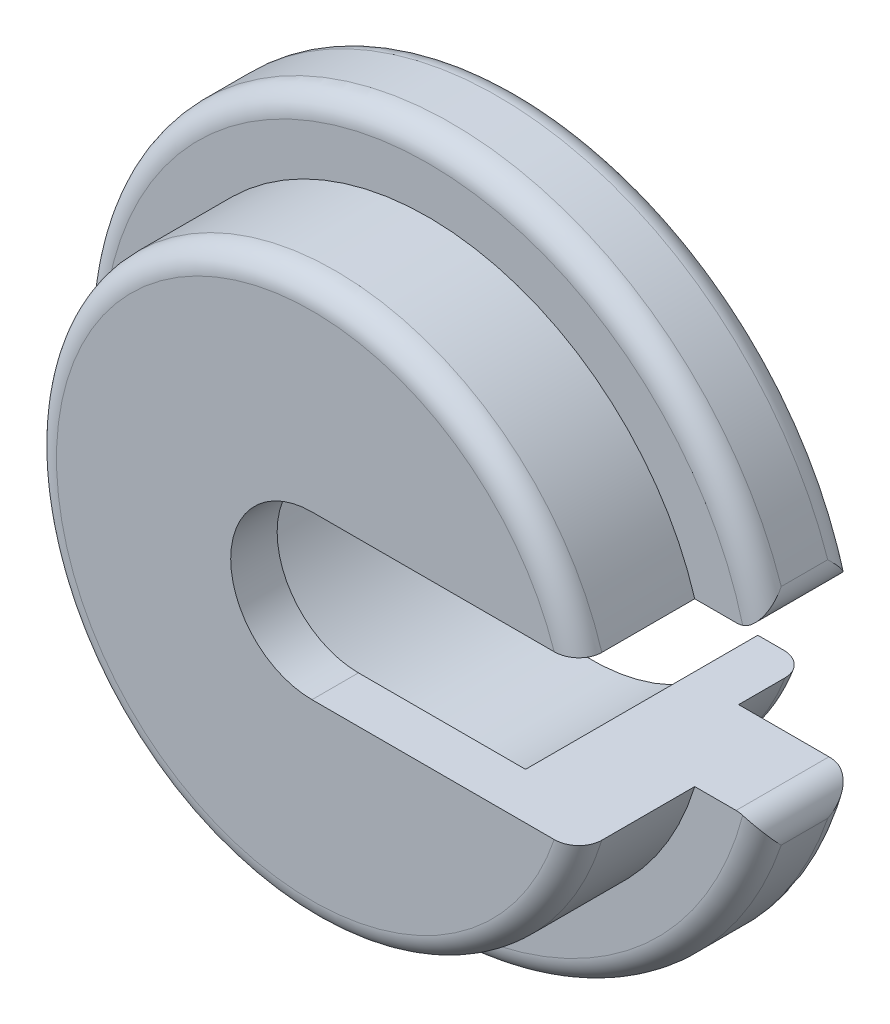
ISO-10303-21;
HEADER;
FILE_DESCRIPTION(('STEP AP214'),'2;1');
FILE_NAME('part.step','',(''),(''),'','','');
FILE_SCHEMA(('AUTOMOTIVE_DESIGN { 1 0 10303 214 1 1 1 1 }'));
ENDSEC;
DATA;
#1=APPLICATION_CONTEXT('core data for automotive mechanical design processes');
#2=APPLICATION_PROTOCOL_DEFINITION('international standard','automotive_design',2000,#1);
#3=PRODUCT_CONTEXT('',#1,'mechanical');
#4=PRODUCT('Part','Part','',(#3));
#5=PRODUCT_RELATED_PRODUCT_CATEGORY('part','',(#4));
#6=PRODUCT_DEFINITION_FORMATION('','',#4);
#7=PRODUCT_DEFINITION_CONTEXT('part definition',#1,'design');
#8=PRODUCT_DEFINITION('design','',#6,#7);
#9=PRODUCT_DEFINITION_SHAPE('','',#8);
#10=(LENGTH_UNIT() NAMED_UNIT(*) SI_UNIT(.MILLI.,.METRE.));
#11=(NAMED_UNIT(*) PLANE_ANGLE_UNIT() SI_UNIT($,.RADIAN.));
#12=(NAMED_UNIT(*) SI_UNIT($,.STERADIAN.) SOLID_ANGLE_UNIT());
#13=UNCERTAINTY_MEASURE_WITH_UNIT(LENGTH_MEASURE(1.E-05),#10,'distance_accuracy_value','');
#14=(GEOMETRIC_REPRESENTATION_CONTEXT(3) GLOBAL_UNCERTAINTY_ASSIGNED_CONTEXT((#13)) GLOBAL_UNIT_ASSIGNED_CONTEXT((#10,
#11,#12)) REPRESENTATION_CONTEXT('',''));
#15=CARTESIAN_POINT('',(0.,0.,0.));
#16=DIRECTION('',(0.,0.,1.));
#17=DIRECTION('',(1.,0.,0.));
#18=AXIS2_PLACEMENT_3D('',#15,#16,#17);
#19=CARTESIAN_POINT('',(0.,0.,0.));
#20=DIRECTION('',(0.,0.,1.));
#21=DIRECTION('',(1.,0.,0.));
#22=AXIS2_PLACEMENT_3D('',#19,#20,#21);
#23=PLANE('',#22);
#24=DIRECTION('',(1.,0.,0.));
#25=VECTOR('',#24,1.);
#26=CARTESIAN_POINT('',(0.,-1.75,0.));
#27=LINE('',#26,#25);
#28=CARTESIAN_POINT('',(4.6837484987988,-1.75,0.));
#29=VERTEX_POINT('',#28);
#30=CARTESIAN_POINT('',(6.62853679178143,-1.75,0.));
#31=VERTEX_POINT('',#30);
#32=EDGE_CURVE('E184',#29,#31,#27,.T.);
#33=ORIENTED_EDGE('',*,*,#32,.T.);
#34=CARTESIAN_POINT('',(6.62853679178142,-2.25,0.));
#35=DIRECTION('',(0.,0.,1.));
#36=DIRECTION('',(1.,0.,0.));
#37=AXIS2_PLACEMENT_3D('',#34,#35,#36);
#38=CIRCLE('',#37,0.5);
#39=CARTESIAN_POINT('',(6.77223901580328,-1.77109534267125,0.));
#40=VERTEX_POINT('',#39);
#41=EDGE_CURVE('E312',#31,#40,#38,.F.);
#42=ORIENTED_EDGE('',*,*,#41,.T.);
#43=CARTESIAN_POINT('',(0.,0.,0.));
#44=DIRECTION('',(0.,0.,1.));
#45=DIRECTION('',(1.,0.,0.));
#46=AXIS2_PLACEMENT_3D('',#43,#44,#45);
#47=CIRCLE('',#46,7.);
#48=CARTESIAN_POINT('',(6.77223901580328,1.77109534267125,0.));
#49=VERTEX_POINT('',#48);
#50=EDGE_CURVE('E315',#40,#49,#47,.F.);
#51=ORIENTED_EDGE('',*,*,#50,.T.);
#52=CARTESIAN_POINT('',(6.62853679178142,2.25,0.));
#53=DIRECTION('',(0.,0.,1.));
#54=DIRECTION('',(1.,0.,0.));
#55=AXIS2_PLACEMENT_3D('',#52,#53,#54);
#56=CIRCLE('',#55,0.5);
#57=CARTESIAN_POINT('',(6.62853679178142,1.75,0.));
#58=VERTEX_POINT('',#57);
#59=EDGE_CURVE('E314',#49,#58,#56,.F.);
#60=ORIENTED_EDGE('',*,*,#59,.T.);
#61=DIRECTION('',(-1.,0.,0.));
#62=VECTOR('',#61,1.);
#63=CARTESIAN_POINT('',(0.,1.75,0.));
#64=LINE('',#63,#62);
#65=CARTESIAN_POINT('',(4.6837484987988,1.75,0.));
#66=VERTEX_POINT('',#65);
#67=EDGE_CURVE('E196',#58,#66,#64,.T.);
#68=ORIENTED_EDGE('',*,*,#67,.T.);
#69=CARTESIAN_POINT('',(0.,0.,0.));
#70=DIRECTION('',(0.,0.,1.));
#71=DIRECTION('',(1.,0.,0.));
#72=AXIS2_PLACEMENT_3D('',#69,#70,#71);
#73=CIRCLE('',#72,5.);
#74=EDGE_CURVE('E212',#29,#66,#73,.F.);
#75=ORIENTED_EDGE('',*,*,#74,.F.);
#76=EDGE_LOOP('',(#33,#42,#51,#60,#68,#75));
#77=FACE_BOUND('',#76,.T.);
#78=ADVANCED_FACE('F31',(#77),#23,.F.);
#79=CARTESIAN_POINT('',(0.,0.,2.));
#80=DIRECTION('',(0.,0.,1.));
#81=DIRECTION('',(1.,0.,0.));
#82=AXIS2_PLACEMENT_3D('',#79,#80,#81);
#83=PLANE('',#82);
#84=CARTESIAN_POINT('',(0.,0.,2.));
#85=DIRECTION('',(0.,0.,1.));
#86=DIRECTION('',(1.,0.,0.));
#87=AXIS2_PLACEMENT_3D('',#84,#85,#86);
#88=CIRCLE('',#87,7.);
#89=CARTESIAN_POINT('',(6.77223901580328,1.77109534267125,2.));
#90=VERTEX_POINT('',#89);
#91=CARTESIAN_POINT('',(6.77223901580328,-1.77109534267125,2.));
#92=VERTEX_POINT('',#91);
#93=EDGE_CURVE('E229',#90,#92,#88,.T.);
#94=ORIENTED_EDGE('',*,*,#93,.T.);
#95=CARTESIAN_POINT('',(6.62853679178142,-2.25,2.));
#96=DIRECTION('',(0.,0.,1.));
#97=DIRECTION('',(1.,0.,0.));
#98=AXIS2_PLACEMENT_3D('',#95,#96,#97);
#99=CIRCLE('',#98,0.5);
#100=CARTESIAN_POINT('',(6.62853679178143,-1.75,2.));
#101=VERTEX_POINT('',#100);
#102=EDGE_CURVE('E233',#92,#101,#99,.T.);
#103=ORIENTED_EDGE('',*,*,#102,.T.);
#104=DIRECTION('',(1.,0.,0.));
#105=VECTOR('',#104,1.);
#106=CARTESIAN_POINT('',(0.,-1.75,2.));
#107=LINE('',#106,#105);
#108=CARTESIAN_POINT('',(5.7391201416245,-1.75,2.));
#109=VERTEX_POINT('',#108);
#110=EDGE_CURVE('E187',#109,#101,#107,.T.);
#111=ORIENTED_EDGE('',*,*,#110,.F.);
#112=CARTESIAN_POINT('',(0.,0.,2.));
#113=DIRECTION('',(0.,0.,1.));
#114=DIRECTION('',(1.,0.,0.));
#115=AXIS2_PLACEMENT_3D('',#112,#113,#114);
#116=CIRCLE('',#115,6.);
#117=CARTESIAN_POINT('',(5.7391201416245,1.75,2.));
#118=VERTEX_POINT('',#117);
#119=EDGE_CURVE('E209',#118,#109,#116,.T.);
#120=ORIENTED_EDGE('',*,*,#119,.F.);
#121=DIRECTION('',(-1.,0.,0.));
#122=VECTOR('',#121,1.);
#123=CARTESIAN_POINT('',(0.,1.75,2.));
#124=LINE('',#123,#122);
#125=CARTESIAN_POINT('',(6.62853679178142,1.75,2.));
#126=VERTEX_POINT('',#125);
#127=EDGE_CURVE('E198',#126,#118,#124,.T.);
#128=ORIENTED_EDGE('',*,*,#127,.F.);
#129=CARTESIAN_POINT('',(6.62853679178142,2.25,2.));
#130=DIRECTION('',(0.,0.,1.));
#131=DIRECTION('',(1.,0.,0.));
#132=AXIS2_PLACEMENT_3D('',#129,#130,#131);
#133=CIRCLE('',#132,0.5);
#134=EDGE_CURVE('E231',#126,#90,#133,.T.);
#135=ORIENTED_EDGE('',*,*,#134,.T.);
#136=EDGE_LOOP('',(#94,#103,#111,#120,#128,#135));
#137=FACE_BOUND('',#136,.T.);
#138=ADVANCED_FACE('F283',(#137),#83,.T.);
#139=CARTESIAN_POINT('',(0.,0.,2.));
#140=DIRECTION('',(0.,0.,-1.));
#141=DIRECTION('',(-1.,0.,0.));
#142=AXIS2_PLACEMENT_3D('',#139,#140,#141);
#143=CYLINDRICAL_SURFACE('',#142,7.5);
#144=CARTESIAN_POINT('',(0.,0.,0.5));
#145=DIRECTION('',(0.,0.,1.));
#146=DIRECTION('',(1.,0.,0.));
#147=AXIS2_PLACEMENT_3D('',#144,#145,#146);
#148=CIRCLE('',#147,7.5);
#149=CARTESIAN_POINT('',(7.1020037054801,2.41071428571429,0.5));
#150=VERTEX_POINT('',#149);
#151=CARTESIAN_POINT('',(7.1020037054801,-2.41071428571429,0.5));
#152=VERTEX_POINT('',#151);
#153=EDGE_CURVE('E224',#150,#152,#148,.T.);
#154=ORIENTED_EDGE('',*,*,#153,.T.);
#155=DIRECTION('',(0.,0.,-1.));
#156=VECTOR('',#155,1.);
#157=CARTESIAN_POINT('',(7.1020037054801,-2.41071428571429,2.));
#158=LINE('',#157,#156);
#159=CARTESIAN_POINT('',(7.1020037054801,-2.41071428571429,1.5));
#160=VERTEX_POINT('',#159);
#161=EDGE_CURVE('E226',#152,#160,#158,.F.);
#162=ORIENTED_EDGE('',*,*,#161,.T.);
#163=CARTESIAN_POINT('',(0.,0.,1.5));
#164=DIRECTION('',(0.,0.,1.));
#165=DIRECTION('',(1.,0.,0.));
#166=AXIS2_PLACEMENT_3D('',#163,#164,#165);
#167=CIRCLE('',#166,7.5);
#168=CARTESIAN_POINT('',(7.1020037054801,2.41071428571429,1.5));
#169=VERTEX_POINT('',#168);
#170=EDGE_CURVE('E220',#160,#169,#167,.F.);
#171=ORIENTED_EDGE('',*,*,#170,.T.);
#172=DIRECTION('',(0.,0.,-1.));
#173=VECTOR('',#172,1.);
#174=CARTESIAN_POINT('',(7.1020037054801,2.41071428571429,2.));
#175=LINE('',#174,#173);
#176=EDGE_CURVE('E222',#169,#150,#175,.T.);
#177=ORIENTED_EDGE('',*,*,#176,.T.);
#178=EDGE_LOOP('',(#154,#162,#171,#177));
#179=FACE_BOUND('',#178,.T.);
#180=ADVANCED_FACE('F33',(#179),#143,.T.);
#181=CARTESIAN_POINT('',(0.,0.,4.5));
#182=DIRECTION('',(0.,0.,-1.));
#183=DIRECTION('',(-1.,0.,0.));
#184=AXIS2_PLACEMENT_3D('',#181,#182,#183);
#185=CYLINDRICAL_SURFACE('',#184,6.);
#186=DIRECTION('',(0.,0.,-1.));
#187=VECTOR('',#186,1.);
#188=CARTESIAN_POINT('',(5.7391201416245,-1.75,4.5));
#189=LINE('',#188,#187);
#190=CARTESIAN_POINT('',(5.7391201416245,-1.75,4.));
#191=VERTEX_POINT('',#190);
#192=EDGE_CURVE('E189',#109,#191,#189,.F.);
#193=ORIENTED_EDGE('',*,*,#192,.T.);
#194=CARTESIAN_POINT('',(0.,0.,4.));
#195=DIRECTION('',(0.,0.,1.));
#196=DIRECTION('',(1.,0.,0.));
#197=AXIS2_PLACEMENT_3D('',#194,#195,#196);
#198=CIRCLE('',#197,6.);
#199=CARTESIAN_POINT('',(5.7391201416245,1.75,4.));
#200=VERTEX_POINT('',#199);
#201=EDGE_CURVE('E11',#191,#200,#198,.F.);
#202=ORIENTED_EDGE('',*,*,#201,.T.);
#203=DIRECTION('',(0.,0.,-1.));
#204=VECTOR('',#203,1.);
#205=CARTESIAN_POINT('',(5.7391201416245,1.75,4.5));
#206=LINE('',#205,#204);
#207=EDGE_CURVE('E201',#200,#118,#206,.T.);
#208=ORIENTED_EDGE('',*,*,#207,.T.);
#209=ORIENTED_EDGE('',*,*,#119,.T.);
#210=EDGE_LOOP('',(#193,#202,#208,#209));
#211=FACE_BOUND('',#210,.T.);
#212=ADVANCED_FACE('F279',(#211),#185,.T.);
#213=CARTESIAN_POINT('',(0.,0.,4.5));
#214=DIRECTION('',(0.,0.,1.));
#215=DIRECTION('',(1.,0.,0.));
#216=AXIS2_PLACEMENT_3D('',#213,#214,#215);
#217=PLANE('',#216);
#218=DIRECTION('',(-1.,0.,0.));
#219=VECTOR('',#218,1.);
#220=CARTESIAN_POINT('',(0.,1.75,4.5));
#221=LINE('',#220,#219);
#222=CARTESIAN_POINT('',(5.21416340365355,1.75,4.5));
#223=VERTEX_POINT('',#222);
#224=CARTESIAN_POINT('',(0.,1.75,4.5));
#225=VERTEX_POINT('',#224);
#226=EDGE_CURVE('E169',#223,#225,#221,.T.);
#227=ORIENTED_EDGE('',*,*,#226,.F.);
#228=CARTESIAN_POINT('',(0.,0.,4.5));
#229=DIRECTION('',(0.,0.,1.));
#230=DIRECTION('',(1.,0.,0.));
#231=AXIS2_PLACEMENT_3D('',#228,#229,#230);
#232=CIRCLE('',#231,5.5);
#233=CARTESIAN_POINT('',(5.21416340365355,-1.75,4.5));
#234=VERTEX_POINT('',#233);
#235=EDGE_CURVE('E39',#223,#234,#232,.T.);
#236=ORIENTED_EDGE('',*,*,#235,.T.);
#237=DIRECTION('',(1.,0.,0.));
#238=VECTOR('',#237,1.);
#239=CARTESIAN_POINT('',(0.,-1.75,4.5));
#240=LINE('',#239,#238);
#241=CARTESIAN_POINT('',(0.,-1.75,4.5));
#242=VERTEX_POINT('',#241);
#243=EDGE_CURVE('E149',#242,#234,#240,.T.);
#244=ORIENTED_EDGE('',*,*,#243,.F.);
#245=CARTESIAN_POINT('',(0.,0.,4.5));
#246=DIRECTION('',(0.,0.,1.));
#247=DIRECTION('',(1.,0.,0.));
#248=AXIS2_PLACEMENT_3D('',#245,#246,#247);
#249=CIRCLE('',#248,1.75);
#250=EDGE_CURVE('E159',#225,#242,#249,.T.);
#251=ORIENTED_EDGE('',*,*,#250,.F.);
#252=EDGE_LOOP('',(#227,#236,#244,#251));
#253=FACE_BOUND('',#252,.T.);
#254=ADVANCED_FACE('F167',(#253),#217,.T.);
#255=CARTESIAN_POINT('',(0.,0.,-1.5));
#256=DIRECTION('',(0.,0.,1.));
#257=DIRECTION('',(1.,0.,0.));
#258=AXIS2_PLACEMENT_3D('',#255,#256,#257);
#259=CYLINDRICAL_SURFACE('',#258,5.);
#260=DIRECTION('',(0.,0.,1.));
#261=VECTOR('',#260,1.);
#262=CARTESIAN_POINT('',(4.6837484987988,1.75,-1.5));
#263=LINE('',#262,#261);
#264=CARTESIAN_POINT('',(4.6837484987988,1.75,-1.));
#265=VERTEX_POINT('',#264);
#266=EDGE_CURVE('E194',#66,#265,#263,.F.);
#267=ORIENTED_EDGE('',*,*,#266,.T.);
#268=CARTESIAN_POINT('',(0.,0.,-1.));
#269=DIRECTION('',(0.,0.,-1.));
#270=DIRECTION('',(-1.,0.,0.));
#271=AXIS2_PLACEMENT_3D('',#268,#269,#270);
#272=CIRCLE('',#271,5.);
#273=CARTESIAN_POINT('',(4.6837484987988,-1.75,-1.));
#274=VERTEX_POINT('',#273);
#275=EDGE_CURVE('E376',#265,#274,#272,.F.);
#276=ORIENTED_EDGE('',*,*,#275,.T.);
#277=DIRECTION('',(0.,0.,1.));
#278=VECTOR('',#277,1.);
#279=CARTESIAN_POINT('',(4.6837484987988,-1.75,-1.5));
#280=LINE('',#279,#278);
#281=EDGE_CURVE('E182',#274,#29,#280,.T.);
#282=ORIENTED_EDGE('',*,*,#281,.T.);
#283=ORIENTED_EDGE('',*,*,#74,.T.);
#284=EDGE_LOOP('',(#267,#276,#282,#283));
#285=FACE_BOUND('',#284,.T.);
#286=ADVANCED_FACE('F272',(#285),#259,.T.);
#287=CARTESIAN_POINT('',(0.,0.,-1.5));
#288=DIRECTION('',(0.,0.,-1.));
#289=DIRECTION('',(-1.,0.,0.));
#290=AXIS2_PLACEMENT_3D('',#287,#288,#289);
#291=PLANE('',#290);
#292=DIRECTION('',(1.,0.,0.));
#293=VECTOR('',#292,1.);
#294=CARTESIAN_POINT('',(0.,-1.75,-1.5));
#295=LINE('',#294,#293);
#296=CARTESIAN_POINT('',(3.59687364248454,-1.75,-1.5));
#297=VERTEX_POINT('',#296);
#298=CARTESIAN_POINT('',(4.14578098794425,-1.75,-1.5));
#299=VERTEX_POINT('',#298);
#300=EDGE_CURVE('E171',#297,#299,#295,.T.);
#301=ORIENTED_EDGE('',*,*,#300,.T.);
#302=CARTESIAN_POINT('',(0.,0.,-1.5));
#303=DIRECTION('',(0.,0.,-1.));
#304=DIRECTION('',(-1.,0.,0.));
#305=AXIS2_PLACEMENT_3D('',#302,#303,#304);
#306=CIRCLE('',#305,4.5);
#307=CARTESIAN_POINT('',(4.14578098794425,1.75,-1.5));
#308=VERTEX_POINT('',#307);
#309=EDGE_CURVE('E374',#299,#308,#306,.T.);
#310=ORIENTED_EDGE('',*,*,#309,.T.);
#311=DIRECTION('',(-1.,0.,0.));
#312=VECTOR('',#311,1.);
#313=CARTESIAN_POINT('',(0.,1.75,-1.5));
#314=LINE('',#313,#312);
#315=CARTESIAN_POINT('',(3.59687364248454,1.75,-1.5));
#316=VERTEX_POINT('',#315);
#317=EDGE_CURVE('E155',#308,#316,#314,.T.);
#318=ORIENTED_EDGE('',*,*,#317,.T.);
#319=CARTESIAN_POINT('',(0.,0.,-1.5));
#320=DIRECTION('',(0.,0.,-1.));
#321=DIRECTION('',(-1.,0.,0.));
#322=AXIS2_PLACEMENT_3D('',#319,#320,#321);
#323=CIRCLE('',#322,4.);
#324=EDGE_CURVE('E203',#297,#316,#323,.T.);
#325=ORIENTED_EDGE('',*,*,#324,.F.);
#326=EDGE_LOOP('',(#301,#310,#318,#325));
#327=FACE_BOUND('',#326,.T.);
#328=ADVANCED_FACE('F268',(#327),#291,.T.);
#329=CARTESIAN_POINT('',(0.,0.,3.5));
#330=DIRECTION('',(0.,0.,-1.));
#331=DIRECTION('',(-1.,0.,0.));
#332=AXIS2_PLACEMENT_3D('',#329,#330,#331);
#333=CYLINDRICAL_SURFACE('',#332,4.);
#334=ORIENTED_EDGE('',*,*,#324,.T.);
#335=DIRECTION('',(0.,0.,-1.));
#336=VECTOR('',#335,1.);
#337=CARTESIAN_POINT('',(3.59687364248454,1.75,3.5));
#338=LINE('',#337,#336);
#339=CARTESIAN_POINT('',(3.59687364248454,1.75,3.5));
#340=VERTEX_POINT('',#339);
#341=EDGE_CURVE('E191',#316,#340,#338,.F.);
#342=ORIENTED_EDGE('',*,*,#341,.T.);
#343=CARTESIAN_POINT('',(0.,0.,3.5));
#344=DIRECTION('',(0.,0.,-1.));
#345=DIRECTION('',(-1.,0.,0.));
#346=AXIS2_PLACEMENT_3D('',#343,#344,#345);
#347=CIRCLE('',#346,4.);
#348=CARTESIAN_POINT('',(3.59687364248454,-1.75,3.5));
#349=VERTEX_POINT('',#348);
#350=EDGE_CURVE('E206',#349,#340,#347,.T.);
#351=ORIENTED_EDGE('',*,*,#350,.F.);
#352=DIRECTION('',(0.,0.,-1.));
#353=VECTOR('',#352,1.);
#354=CARTESIAN_POINT('',(3.59687364248454,-1.75,3.5));
#355=LINE('',#354,#353);
#356=EDGE_CURVE('E178',#349,#297,#355,.T.);
#357=ORIENTED_EDGE('',*,*,#356,.T.);
#358=EDGE_LOOP('',(#334,#342,#351,#357));
#359=FACE_BOUND('',#358,.T.);
#360=ADVANCED_FACE('F264',(#359),#333,.F.);
#361=CARTESIAN_POINT('',(0.,0.,3.5));
#362=DIRECTION('',(0.,0.,-1.));
#363=DIRECTION('',(-1.,0.,0.));
#364=AXIS2_PLACEMENT_3D('',#361,#362,#363);
#365=PLANE('',#364);
#366=DIRECTION('',(1.,0.,0.));
#367=VECTOR('',#366,1.);
#368=CARTESIAN_POINT('',(0.,1.75,3.5));
#369=LINE('',#368,#367);
#370=CARTESIAN_POINT('',(0.,1.75,3.5));
#371=VERTEX_POINT('',#370);
#372=EDGE_CURVE('E218',#371,#340,#369,.T.);
#373=ORIENTED_EDGE('',*,*,#372,.F.);
#374=CARTESIAN_POINT('',(0.,0.,3.5));
#375=DIRECTION('',(0.,0.,-1.));
#376=DIRECTION('',(-1.,0.,0.));
#377=AXIS2_PLACEMENT_3D('',#374,#375,#376);
#378=CIRCLE('',#377,1.75);
#379=CARTESIAN_POINT('',(0.,-1.75,3.5));
#380=VERTEX_POINT('',#379);
#381=EDGE_CURVE('E216',#380,#371,#378,.T.);
#382=ORIENTED_EDGE('',*,*,#381,.F.);
#383=DIRECTION('',(-1.,0.,0.));
#384=VECTOR('',#383,1.);
#385=CARTESIAN_POINT('',(0.,-1.75,3.5));
#386=LINE('',#385,#384);
#387=EDGE_CURVE('E151',#349,#380,#386,.T.);
#388=ORIENTED_EDGE('',*,*,#387,.F.);
#389=ORIENTED_EDGE('',*,*,#350,.T.);
#390=EDGE_LOOP('',(#373,#382,#388,#389));
#391=FACE_BOUND('',#390,.T.);
#392=ADVANCED_FACE('F261',(#391),#365,.T.);
#393=CARTESIAN_POINT('',(0.,1.75,-1.5));
#394=DIRECTION('',(0.,1.,0.));
#395=DIRECTION('',(0.,0.,1.));
#396=AXIS2_PLACEMENT_3D('',#393,#394,#395);
#397=PLANE('',#396);
#398=ORIENTED_EDGE('',*,*,#67,.F.);
#399=DIRECTION('',(0.,0.,-1.));
#400=VECTOR('',#399,1.);
#401=CARTESIAN_POINT('',(6.62853679178142,1.75,-1.5));
#402=LINE('',#401,#400);
#403=EDGE_CURVE('E329',#58,#126,#402,.F.);
#404=ORIENTED_EDGE('',*,*,#403,.T.);
#405=ORIENTED_EDGE('',*,*,#127,.T.);
#406=ORIENTED_EDGE('',*,*,#207,.F.);
#407=CARTESIAN_POINT('',(5.7391201416245,1.75,4.));
#408=CARTESIAN_POINT('',(5.73914859977898,1.75,4.02722451157571));
#409=CARTESIAN_POINT('',(5.73679745142537,1.75,4.05443529477964));
#410=CARTESIAN_POINT('',(5.7275538108366,1.75,4.10802220875837));
#411=CARTESIAN_POINT('',(5.72067010588289,1.75,4.13439985125614));
#412=CARTESIAN_POINT('',(5.70257692065409,1.75,4.18562657790316));
#413=CARTESIAN_POINT('',(5.69136706720579,1.75,4.21047552997325));
#414=CARTESIAN_POINT('',(5.6650057874774,1.75,4.25798481757399));
#415=CARTESIAN_POINT('',(5.6498537907701,1.75,4.28064483571516));
#416=CARTESIAN_POINT('',(5.61579074807385,1.75,4.32358413459604));
#417=CARTESIAN_POINT('',(5.59681872337044,1.75,4.34381497425831));
#418=CARTESIAN_POINT('',(5.55586701333869,1.75,4.38095945386265));
#419=CARTESIAN_POINT('',(5.53388667474401,1.75,4.39787237135933));
#420=CARTESIAN_POINT('',(5.48657930029313,1.75,4.42865297656592));
#421=CARTESIAN_POINT('',(5.46115126535445,1.75,4.44236525600174));
#422=CARTESIAN_POINT('',(5.4084238588574,1.75,4.46553806447844));
#423=CARTESIAN_POINT('',(5.38112421763679,1.75,4.47499797934585));
#424=CARTESIAN_POINT('',(5.3305604097015,1.75,4.48815777040163));
#425=CARTESIAN_POINT('',(5.30748568085787,1.75,4.49260010905143));
#426=CARTESIAN_POINT('',(5.26099587711348,1.75,4.49852126964513));
#427=CARTESIAN_POINT('',(5.23758139978198,1.75,4.50000477868597));
#428=CARTESIAN_POINT('',(5.21416340365355,1.75,4.5));
#429=B_SPLINE_CURVE_WITH_KNOTS('',3,(#407,#408,#409,#410,#411,#412,#413,#414,#415,#416,#417,
#418,#419,#420,#421,#422,#423,#424,#425,#426,#427,#428),.UNSPECIFIED.,.F.,.F.,(4,2,2,2,2,2,2,2,
2,2,4),(0.,0.0815512735744263,0.162944907126926,0.24434556325746,0.325758004601307,
0.408591020597108,0.491442052709262,0.577729595495474,0.664029596880945,0.734340360026582,
0.804539654792602),.UNSPECIFIED.);
#430=EDGE_CURVE('E320',#200,#223,#429,.T.);
#431=ORIENTED_EDGE('',*,*,#430,.T.);
#432=ORIENTED_EDGE('',*,*,#226,.T.);
#433=DIRECTION('',(0.,0.,1.));
#434=VECTOR('',#433,1.);
#435=CARTESIAN_POINT('',(0.,1.75,-1.5));
#436=LINE('',#435,#434);
#437=EDGE_CURVE('E154',#371,#225,#436,.T.);
#438=ORIENTED_EDGE('',*,*,#437,.F.);
#439=ORIENTED_EDGE('',*,*,#372,.T.);
#440=ORIENTED_EDGE('',*,*,#341,.F.);
#441=ORIENTED_EDGE('',*,*,#317,.F.);
#442=CARTESIAN_POINT('',(4.14578098794425,1.75,-1.5));
#443=CARTESIAN_POINT('',(4.17793958901466,1.75,-1.50001747294155));
#444=CARTESIAN_POINT('',(4.21011428619823,1.75,-1.49736700552021));
#445=CARTESIAN_POINT('',(4.27364915933794,1.75,-1.4867760270329));
#446=CARTESIAN_POINT('',(4.30500744500507,1.75,-1.47882420815263));
#447=CARTESIAN_POINT('',(4.36596937769272,1.75,-1.45765867620717));
#448=CARTESIAN_POINT('',(4.39556993300684,1.75,-1.44443598973693));
#449=CARTESIAN_POINT('',(4.4519422063235,1.75,-1.41296732359334));
#450=CARTESIAN_POINT('',(4.47871702869892,1.75,-1.39472693759276));
#451=CARTESIAN_POINT('',(4.52722789022789,1.75,-1.3546504597076));
#452=CARTESIAN_POINT('',(4.54914795488512,1.75,-1.33303752605647));
#453=CARTESIAN_POINT('',(4.58871450985095,1.75,-1.28617936124539));
#454=CARTESIAN_POINT('',(4.6063609924231,1.75,-1.26093412351002));
#455=CARTESIAN_POINT('',(4.63553685467951,1.75,-1.20949031585461));
#456=CARTESIAN_POINT('',(4.64741214626956,1.75,-1.18348739046096));
#457=CARTESIAN_POINT('',(4.66632579394178,1.75,-1.12979805970136));
#458=CARTESIAN_POINT('',(4.67337202388696,1.75,-1.10211447531174));
#459=CARTESIAN_POINT('',(4.67982108897615,1.75,-1.06180426014855));
#460=CARTESIAN_POINT('',(4.68129363946103,1.75,-1.04947978188883));
#461=CARTESIAN_POINT('',(4.68325640956408,1.75,-1.02477236313839));
#462=CARTESIAN_POINT('',(4.68374817075864,1.75,-1.01238954510491));
#463=CARTESIAN_POINT('',(4.68374849879887,1.75,-1.00000000000001));
#464=B_SPLINE_CURVE_WITH_KNOTS('',3,(#442,#443,#444,#445,#446,#447,#448,#449,#450,#451,#452,
#453,#454,#455,#456,#457,#458,#459,#460,#461,#462,#463),.UNSPECIFIED.,.F.,.F.,(4,2,2,2,2,2,2,2,
2,2,4),(0.,0.0963929343184209,0.192992135984912,0.28975650047221,0.38641342729687,
0.478277298014871,0.570141335032602,0.655468934475541,0.740657072753023,0.777861149294878,
0.815006703310541),.UNSPECIFIED.);
#465=EDGE_CURVE('E52',#308,#265,#464,.T.);
#466=ORIENTED_EDGE('',*,*,#465,.T.);
#467=ORIENTED_EDGE('',*,*,#266,.F.);
#468=EDGE_LOOP('',(#398,#404,#405,#406,#431,#432,#438,#439,#440,#441,#466,#467));
#469=FACE_BOUND('',#468,.T.);
#470=ADVANCED_FACE('F254',(#469),#397,.F.);
#471=CARTESIAN_POINT('',(0.,-1.75,-1.5));
#472=DIRECTION('',(0.,-1.,0.));
#473=DIRECTION('',(0.,0.,-1.));
#474=AXIS2_PLACEMENT_3D('',#471,#472,#473);
#475=PLANE('',#474);
#476=ORIENTED_EDGE('',*,*,#110,.T.);
#477=DIRECTION('',(0.,0.,-1.));
#478=VECTOR('',#477,1.);
#479=CARTESIAN_POINT('',(6.62853679178142,-1.75,-1.5));
#480=LINE('',#479,#478);
#481=EDGE_CURVE('E310',#101,#31,#480,.T.);
#482=ORIENTED_EDGE('',*,*,#481,.T.);
#483=ORIENTED_EDGE('',*,*,#32,.F.);
#484=ORIENTED_EDGE('',*,*,#281,.F.);
#485=CARTESIAN_POINT('',(4.6837484987988,-1.75,-1.));
#486=CARTESIAN_POINT('',(4.68377880748665,-1.75,-1.02680939897035));
#487=CARTESIAN_POINT('',(4.68144877193849,-1.75,-1.05360232030611));
#488=CARTESIAN_POINT('',(4.6723028951644,-1.75,-1.106347155274));
#489=CARTESIAN_POINT('',(4.66549790671785,-1.75,-1.13230094462191));
#490=CARTESIAN_POINT('',(4.6476357181582,-1.75,-1.18269408264278));
#491=CARTESIAN_POINT('',(4.63657887533947,-1.75,-1.20713355836712));
#492=CARTESIAN_POINT('',(4.61061525369643,-1.75,-1.25387444082593));
#493=CARTESIAN_POINT('',(4.59570738685567,-1.75,-1.27617524088219));
#494=CARTESIAN_POINT('',(4.5621254108022,-1.75,-1.31862775681851));
#495=CARTESIAN_POINT('',(4.54336794394441,-1.75,-1.33871339867193));
#496=CARTESIAN_POINT('',(4.50291878960977,-1.75,-1.37566665179797));
#497=CARTESIAN_POINT('',(4.48122651803318,-1.75,-1.39253362085908));
#498=CARTESIAN_POINT('',(4.43414759139924,-1.75,-1.42365948207911));
#499=CARTESIAN_POINT('',(4.40861728192956,-1.75,-1.43770081313069));
#500=CARTESIAN_POINT('',(4.35566530860214,-1.75,-1.46161441230595));
#501=CARTESIAN_POINT('',(4.3282427033766,-1.75,-1.47148458773978));
#502=CARTESIAN_POINT('',(4.27509535300766,-1.75,-1.48614204926751));
#503=CARTESIAN_POINT('',(4.2494839477992,-1.75,-1.49134605631569));
#504=CARTESIAN_POINT('',(4.19784047278474,-1.75,-1.49827491919633));
#505=CARTESIAN_POINT('',(4.1718092395004,-1.75,-1.50000599596612));
#506=CARTESIAN_POINT('',(4.14578098794425,-1.75,-1.5));
#507=B_SPLINE_CURVE_WITH_KNOTS('',3,(#485,#486,#487,#488,#489,#490,#491,#492,#493,#494,#495,
#496,#497,#498,#499,#500,#501,#502,#503,#504,#505,#506),.UNSPECIFIED.,.F.,.F.,(4,2,2,2,2,2,2,2,
2,2,4),(0.,0.0803017546491845,0.160409473968742,0.240510463098915,0.32063410768219,
0.40272165664933,0.484825567196844,0.571862010142009,0.658942068018699,0.73711282333416,
0.815143428666879),.UNSPECIFIED.);
#508=EDGE_CURVE('E242',#274,#299,#507,.T.);
#509=ORIENTED_EDGE('',*,*,#508,.T.);
#510=ORIENTED_EDGE('',*,*,#300,.F.);
#511=ORIENTED_EDGE('',*,*,#356,.F.);
#512=ORIENTED_EDGE('',*,*,#387,.T.);
#513=DIRECTION('',(0.,0.,1.));
#514=VECTOR('',#513,1.);
#515=CARTESIAN_POINT('',(0.,-1.75,-1.5));
#516=LINE('',#515,#514);
#517=EDGE_CURVE('E144',#380,#242,#516,.T.);
#518=ORIENTED_EDGE('',*,*,#517,.T.);
#519=ORIENTED_EDGE('',*,*,#243,.T.);
#520=CARTESIAN_POINT('',(5.21416340365355,-1.75,4.5));
#521=CARTESIAN_POINT('',(5.24487065279054,-1.75,4.50001960941325));
#522=CARTESIAN_POINT('',(5.27558416493397,-1.75,4.49745835613115));
#523=CARTESIAN_POINT('',(5.33619118018395,-1.75,4.48727542954986));
#524=CARTESIAN_POINT('',(5.36608383028303,-1.75,4.47964868528837));
#525=CARTESIAN_POINT('',(5.42418684872629,-1.75,4.45942417753369));
#526=CARTESIAN_POINT('',(5.45239512752571,-1.75,4.44682038143549));
#527=CARTESIAN_POINT('',(5.50618728942885,-1.75,4.41692099318433));
#528=CARTESIAN_POINT('',(5.53177307473399,-1.75,4.39962883535695));
#529=CARTESIAN_POINT('',(5.57875543089639,-1.75,4.36135619406549));
#530=CARTESIAN_POINT('',(5.60025458166251,-1.75,4.34050179992757));
#531=CARTESIAN_POINT('',(5.63924054095762,-1.75,4.29531327503549));
#532=CARTESIAN_POINT('',(5.65672701703522,-1.75,4.27097885623107));
#533=CARTESIAN_POINT('',(5.68630866923167,-1.75,4.22076742219906));
#534=CARTESIAN_POINT('',(5.69861864477285,-1.75,4.19501670047932));
#535=CARTESIAN_POINT('',(5.71853276920456,-1.75,4.14177113116012));
#536=CARTESIAN_POINT('',(5.72614289327435,-1.75,4.11427854734768));
#537=CARTESIAN_POINT('',(5.73387755560218,-1.75,4.07210834118917));
#538=CARTESIAN_POINT('',(5.73584282680587,-1.75,4.0577462830278));
#539=CARTESIAN_POINT('',(5.73846328354111,-1.75,4.02892528651386));
#540=CARTESIAN_POINT('',(5.73912046502834,-1.75,4.01446652958979));
#541=CARTESIAN_POINT('',(5.73912014162476,-1.75,4.00000000000005));
#542=B_SPLINE_CURVE_WITH_KNOTS('',3,(#520,#521,#522,#523,#524,#525,#526,#527,#528,#529,#530,
#531,#532,#533,#534,#535,#536,#537,#538,#539,#540,#541),.UNSPECIFIED.,.F.,.F.,(4,2,2,2,2,2,2,2,
2,2,4),(0.,0.0920259840900414,0.18414423269958,0.276374480785966,0.368537349921943,
0.457937739448036,0.547345533153229,0.632550302839905,0.717646522814314,0.76108221178946,
0.804451573223965),.UNSPECIFIED.);
#543=EDGE_CURVE('E235',#234,#191,#542,.T.);
#544=ORIENTED_EDGE('',*,*,#543,.T.);
#545=ORIENTED_EDGE('',*,*,#192,.F.);
#546=EDGE_LOOP('',(#476,#482,#483,#484,#509,#510,#511,#512,#518,#519,#544,#545));
#547=FACE_BOUND('',#546,.T.);
#548=ADVANCED_FACE('F147',(#547),#475,.F.);
#549=CARTESIAN_POINT('',(0.,0.,-1.5));
#550=DIRECTION('',(0.,0.,1.));
#551=DIRECTION('',(1.,0.,0.));
#552=AXIS2_PLACEMENT_3D('',#549,#550,#551);
#553=CYLINDRICAL_SURFACE('',#552,1.75);
#554=ORIENTED_EDGE('',*,*,#381,.T.);
#555=ORIENTED_EDGE('',*,*,#437,.T.);
#556=ORIENTED_EDGE('',*,*,#250,.T.);
#557=ORIENTED_EDGE('',*,*,#517,.F.);
#558=EDGE_LOOP('',(#554,#555,#556,#557));
#559=FACE_BOUND('',#558,.T.);
#560=ADVANCED_FACE('F160',(#559),#553,.F.);
#561=CARTESIAN_POINT('',(6.62853679178142,2.25,2.));
#562=DIRECTION('',(0.,0.,-1.));
#563=DIRECTION('',(-1.,0.,0.));
#564=AXIS2_PLACEMENT_3D('',#561,#562,#563);
#565=CYLINDRICAL_SURFACE('',#564,0.5);
#566=ORIENTED_EDGE('',*,*,#403,.F.);
#567=ORIENTED_EDGE('',*,*,#59,.F.);
#568=CARTESIAN_POINT('',(6.77223901580328,1.77109534267125,0.));
#569=CARTESIAN_POINT('',(6.79392531172874,1.77756357371953,-3.53522721426997E-05));
#570=CARTESIAN_POINT('',(6.81508958297233,1.78555452714966,0.00153206800287684));
#571=CARTESIAN_POINT('',(6.85566030535027,1.80402132116905,0.00750803775757951));
#572=CARTESIAN_POINT('',(6.87508050018945,1.81447483902278,0.0118916421439867));
#573=CARTESIAN_POINT('',(6.91179124766995,1.83740141613144,0.023129912872709));
#574=CARTESIAN_POINT('',(6.92908805475435,1.84986828098597,0.0299770765735934));
#575=CARTESIAN_POINT('',(6.96145087011608,1.87636065202734,0.0457159605317059));
#576=CARTESIAN_POINT('',(6.97651155622212,1.89038974196821,0.0546124339936232));
#577=CARTESIAN_POINT('',(7.00996396929981,1.92547596987413,0.0779813685994546));
#578=CARTESIAN_POINT('',(7.02722895335283,1.9470756615051,0.0932518500116733));
#579=CARTESIAN_POINT('',(7.05739339247348,1.99153048853048,0.126084529522909));
#580=CARTESIAN_POINT('',(7.07028510734555,2.01438776750054,0.143650715452672));
#581=CARTESIAN_POINT('',(7.09589970310766,2.0689591820895,0.18693943687686));
#582=CARTESIAN_POINT('',(7.10692825498934,2.10092921722352,0.213339187914916));
#583=CARTESIAN_POINT('',(7.12234215038554,2.16490557602469,0.267947242131054));
#584=CARTESIAN_POINT('',(7.12671896617357,2.19691189371805,0.296157818659743));
#585=CARTESIAN_POINT('',(7.12940254202278,2.25945520247073,0.352921405893001));
#586=CARTESIAN_POINT('',(7.1278517159514,2.29000902974152,0.381450164507183));
#587=CARTESIAN_POINT('',(7.11939258136213,2.34985506730149,0.438922921227178));
#588=CARTESIAN_POINT('',(7.1124958788847,2.37914986574127,0.467865886636671));
#589=CARTESIAN_POINT('',(7.10271359715996,2.40861143056448,0.497855813232545));
#590=CARTESIAN_POINT('',(7.1023603907804,2.40966347484564,0.498927930630054));
#591=CARTESIAN_POINT('',(7.1020037054801,2.41071428571429,0.5));
#592=B_SPLINE_CURVE_WITH_KNOTS('',3,(#568,#569,#570,#571,#572,#573,#574,#575,#576,#577,#578,
#579,#580,#581,#582,#583,#584,#585,#586,#587,#588,#589,#590,#591),.UNSPECIFIED.,.F.,.F.,(4,2,2,
2,2,2,2,2,2,2,2,4),(0.,0.0676845841263153,0.13477774909628,0.201668291254748,0.268715571155745,
0.362958428476435,0.457367225287556,0.585389388734211,0.713575542415444,0.838701554799033,
0.963556673520585,0.968185787288954),.UNSPECIFIED.);
#593=EDGE_CURVE('E164',#150,#49,#592,.F.);
#594=ORIENTED_EDGE('',*,*,#593,.F.);
#595=ORIENTED_EDGE('',*,*,#176,.F.);
#596=CARTESIAN_POINT('',(6.77223901580328,1.77109534267125,2.));
#597=CARTESIAN_POINT('',(6.79392531172874,1.77756357371953,2.00003535227214));
#598=CARTESIAN_POINT('',(6.81508958297233,1.78555452714966,1.99846793199712));
#599=CARTESIAN_POINT('',(6.85566030535027,1.80402132116905,1.99249196224242));
#600=CARTESIAN_POINT('',(6.87508050018945,1.81447483902278,1.98810835785601));
#601=CARTESIAN_POINT('',(6.91179124766995,1.83740141613144,1.97687008712729));
#602=CARTESIAN_POINT('',(6.92908805475435,1.84986828098597,1.97002292342641));
#603=CARTESIAN_POINT('',(6.96145087011608,1.87636065202734,1.95428403946829));
#604=CARTESIAN_POINT('',(6.97651155622212,1.89038974196821,1.94538756600638));
#605=CARTESIAN_POINT('',(7.00996396929981,1.92547596987413,1.92201863140055));
#606=CARTESIAN_POINT('',(7.02722895335283,1.9470756615051,1.90674814998833));
#607=CARTESIAN_POINT('',(7.05739339247348,1.99153048853048,1.87391547047709));
#608=CARTESIAN_POINT('',(7.07028510734555,2.01438776750054,1.85634928454733));
#609=CARTESIAN_POINT('',(7.09589970310766,2.0689591820895,1.81306056312314));
#610=CARTESIAN_POINT('',(7.10692825498934,2.10092921722352,1.78666081208508));
#611=CARTESIAN_POINT('',(7.12234215038554,2.16490557602469,1.73205275786895));
#612=CARTESIAN_POINT('',(7.12671896617357,2.19691189371805,1.70384218134026));
#613=CARTESIAN_POINT('',(7.12940254202278,2.25945520247073,1.647078594107));
#614=CARTESIAN_POINT('',(7.1278517159514,2.29000902974152,1.61854983549282));
#615=CARTESIAN_POINT('',(7.11939258136213,2.34985506730149,1.56107707877282));
#616=CARTESIAN_POINT('',(7.1124958788847,2.37914986574127,1.53213411336333));
#617=CARTESIAN_POINT('',(7.10271359715996,2.40861143056448,1.50214418676746));
#618=CARTESIAN_POINT('',(7.1023603907804,2.40966347484564,1.50107206936995));
#619=CARTESIAN_POINT('',(7.1020037054801,2.41071428571429,1.5));
#620=B_SPLINE_CURVE_WITH_KNOTS('',3,(#596,#597,#598,#599,#600,#601,#602,#603,#604,#605,#606,
#607,#608,#609,#610,#611,#612,#613,#614,#615,#616,#617,#618,#619),.UNSPECIFIED.,.F.,.F.,(4,2,2,
2,2,2,2,2,2,2,2,4),(0.,0.0676845841263153,0.13477774909628,0.201668291254748,0.268715571155745,
0.362958428476435,0.457367225287556,0.585389388734211,0.713575542415444,0.838701554799033,
0.963556673520585,0.968185787288954),.UNSPECIFIED.);
#621=EDGE_CURVE('E351',#90,#169,#620,.T.);
#622=ORIENTED_EDGE('',*,*,#621,.F.);
#623=ORIENTED_EDGE('',*,*,#134,.F.);
#624=EDGE_LOOP('',(#566,#567,#594,#595,#622,#623));
#625=FACE_BOUND('',#624,.T.);
#626=ADVANCED_FACE('F260',(#625),#565,.T.);
#627=CARTESIAN_POINT('',(0.,0.,0.5));
#628=DIRECTION('',(0.,0.,1.));
#629=DIRECTION('',(1.,0.,0.));
#630=AXIS2_PLACEMENT_3D('',#627,#628,#629);
#631=TOROIDAL_SURFACE('',#630,7.,0.5);
#632=ORIENTED_EDGE('',*,*,#593,.T.);
#633=ORIENTED_EDGE('',*,*,#50,.F.);
#634=CARTESIAN_POINT('',(6.77223901580328,-1.77109534267125,0.));
#635=CARTESIAN_POINT('',(6.79392531172874,-1.77756357371953,-3.53522721426997E-05));
#636=CARTESIAN_POINT('',(6.81508958297233,-1.78555452714966,0.00153206800287684));
#637=CARTESIAN_POINT('',(6.85566030535027,-1.80402132116905,0.00750803775757951));
#638=CARTESIAN_POINT('',(6.87508050018945,-1.81447483902278,0.0118916421439867));
#639=CARTESIAN_POINT('',(6.91179124766995,-1.83740141613144,0.023129912872709));
#640=CARTESIAN_POINT('',(6.92908805475435,-1.84986828098597,0.0299770765735934));
#641=CARTESIAN_POINT('',(6.96145087011608,-1.87636065202734,0.0457159605317059));
#642=CARTESIAN_POINT('',(6.97651155622212,-1.89038974196821,0.0546124339936232));
#643=CARTESIAN_POINT('',(7.00996396929981,-1.92547596987413,0.0779813685994546));
#644=CARTESIAN_POINT('',(7.02722895335283,-1.9470756615051,0.0932518500116733));
#645=CARTESIAN_POINT('',(7.05739339247348,-1.99153048853048,0.126084529522909));
#646=CARTESIAN_POINT('',(7.07028510734555,-2.01438776750054,0.143650715452672));
#647=CARTESIAN_POINT('',(7.09589970310766,-2.0689591820895,0.18693943687686));
#648=CARTESIAN_POINT('',(7.10692825498934,-2.10092921722352,0.213339187914916));
#649=CARTESIAN_POINT('',(7.12234215038554,-2.16490557602469,0.267947242131054));
#650=CARTESIAN_POINT('',(7.12671896617357,-2.19691189371805,0.296157818659743));
#651=CARTESIAN_POINT('',(7.12940254202278,-2.25945520247073,0.352921405893001));
#652=CARTESIAN_POINT('',(7.1278517159514,-2.29000902974152,0.381450164507183));
#653=CARTESIAN_POINT('',(7.11939258136213,-2.34985506730149,0.438922921227178));
#654=CARTESIAN_POINT('',(7.1124958788847,-2.37914986574127,0.467865886636671));
#655=CARTESIAN_POINT('',(7.10271359715996,-2.40861143056448,0.497855813232545));
#656=CARTESIAN_POINT('',(7.1023603907804,-2.40966347484564,0.498927930630054));
#657=CARTESIAN_POINT('',(7.1020037054801,-2.41071428571429,0.5));
#658=B_SPLINE_CURVE_WITH_KNOTS('',3,(#634,#635,#636,#637,#638,#639,#640,#641,#642,#643,#644,
#645,#646,#647,#648,#649,#650,#651,#652,#653,#654,#655,#656,#657),.UNSPECIFIED.,.F.,.F.,(4,2,2,
2,2,2,2,2,2,2,2,4),(0.,0.0676845841263153,0.13477774909628,0.201668291254748,0.268715571155745,
0.362958428476435,0.457367225287556,0.585389388734211,0.713575542415444,0.838701554799033,
0.963556673520585,0.968185787288954),.UNSPECIFIED.);
#659=EDGE_CURVE('E305',#152,#40,#658,.F.);
#660=ORIENTED_EDGE('',*,*,#659,.F.);
#661=ORIENTED_EDGE('',*,*,#153,.F.);
#662=EDGE_LOOP('',(#632,#633,#660,#661));
#663=FACE_BOUND('',#662,.T.);
#664=ADVANCED_FACE('F355',(#663),#631,.T.);
#665=CARTESIAN_POINT('',(0.,0.,1.5));
#666=DIRECTION('',(0.,0.,1.));
#667=DIRECTION('',(1.,0.,0.));
#668=AXIS2_PLACEMENT_3D('',#665,#666,#667);
#669=TOROIDAL_SURFACE('',#668,7.,0.5);
#670=ORIENTED_EDGE('',*,*,#621,.T.);
#671=ORIENTED_EDGE('',*,*,#170,.F.);
#672=CARTESIAN_POINT('',(6.77223901580328,-1.77109534267125,2.));
#673=CARTESIAN_POINT('',(6.79392531172874,-1.77756357371953,2.00003535227214));
#674=CARTESIAN_POINT('',(6.81508958297233,-1.78555452714966,1.99846793199712));
#675=CARTESIAN_POINT('',(6.85566030535027,-1.80402132116905,1.99249196224242));
#676=CARTESIAN_POINT('',(6.87508050018945,-1.81447483902278,1.98810835785601));
#677=CARTESIAN_POINT('',(6.91179124766995,-1.83740141613144,1.97687008712729));
#678=CARTESIAN_POINT('',(6.92908805475435,-1.84986828098597,1.97002292342641));
#679=CARTESIAN_POINT('',(6.96145087011608,-1.87636065202734,1.95428403946829));
#680=CARTESIAN_POINT('',(6.97651155622212,-1.89038974196821,1.94538756600638));
#681=CARTESIAN_POINT('',(7.00996396929981,-1.92547596987413,1.92201863140055));
#682=CARTESIAN_POINT('',(7.02722895335283,-1.9470756615051,1.90674814998833));
#683=CARTESIAN_POINT('',(7.05739339247348,-1.99153048853048,1.87391547047709));
#684=CARTESIAN_POINT('',(7.07028510734555,-2.01438776750054,1.85634928454733));
#685=CARTESIAN_POINT('',(7.09589970310766,-2.0689591820895,1.81306056312314));
#686=CARTESIAN_POINT('',(7.10692825498934,-2.10092921722352,1.78666081208508));
#687=CARTESIAN_POINT('',(7.12234215038554,-2.16490557602469,1.73205275786895));
#688=CARTESIAN_POINT('',(7.12671896617357,-2.19691189371805,1.70384218134026));
#689=CARTESIAN_POINT('',(7.12940254202278,-2.25945520247073,1.647078594107));
#690=CARTESIAN_POINT('',(7.1278517159514,-2.29000902974153,1.61854983549282));
#691=CARTESIAN_POINT('',(7.11939258136213,-2.34985506730149,1.56107707877282));
#692=CARTESIAN_POINT('',(7.1124958788847,-2.37914986574127,1.53213411336333));
#693=CARTESIAN_POINT('',(7.10271359715996,-2.40861143056448,1.50214418676746));
#694=CARTESIAN_POINT('',(7.1023603907804,-2.40966347484564,1.50107206936995));
#695=CARTESIAN_POINT('',(7.1020037054801,-2.41071428571429,1.5));
#696=B_SPLINE_CURVE_WITH_KNOTS('',3,(#672,#673,#674,#675,#676,#677,#678,#679,#680,#681,#682,
#683,#684,#685,#686,#687,#688,#689,#690,#691,#692,#693,#694,#695),.UNSPECIFIED.,.F.,.F.,(4,2,2,
2,2,2,2,2,2,2,2,4),(0.,0.0676845841263153,0.13477774909628,0.201668291254748,0.268715571155745,
0.362958428476435,0.457367225287556,0.585389388734211,0.713575542415445,0.838701554799033,
0.963556673520585,0.968185787288954),.UNSPECIFIED.);
#697=EDGE_CURVE('E301',#92,#160,#696,.T.);
#698=ORIENTED_EDGE('',*,*,#697,.F.);
#699=ORIENTED_EDGE('',*,*,#93,.F.);
#700=EDGE_LOOP('',(#670,#671,#698,#699));
#701=FACE_BOUND('',#700,.T.);
#702=ADVANCED_FACE('F302',(#701),#669,.T.);
#703=CARTESIAN_POINT('',(6.62853679178142,-2.25,2.));
#704=DIRECTION('',(0.,0.,-1.));
#705=DIRECTION('',(-1.,0.,0.));
#706=AXIS2_PLACEMENT_3D('',#703,#704,#705);
#707=CYLINDRICAL_SURFACE('',#706,0.5);
#708=ORIENTED_EDGE('',*,*,#41,.F.);
#709=ORIENTED_EDGE('',*,*,#481,.F.);
#710=ORIENTED_EDGE('',*,*,#102,.F.);
#711=ORIENTED_EDGE('',*,*,#697,.T.);
#712=ORIENTED_EDGE('',*,*,#161,.F.);
#713=ORIENTED_EDGE('',*,*,#659,.T.);
#714=EDGE_LOOP('',(#708,#709,#710,#711,#712,#713));
#715=FACE_BOUND('',#714,.T.);
#716=ADVANCED_FACE('F308',(#715),#707,.T.);
#717=CARTESIAN_POINT('',(0.,0.,-1.));
#718=DIRECTION('',(0.,0.,-1.));
#719=DIRECTION('',(-1.,0.,0.));
#720=AXIS2_PLACEMENT_3D('',#717,#718,#719);
#721=TOROIDAL_SURFACE('',#720,4.5,0.5);
#722=ORIENTED_EDGE('',*,*,#508,.F.);
#723=ORIENTED_EDGE('',*,*,#275,.F.);
#724=ORIENTED_EDGE('',*,*,#465,.F.);
#725=ORIENTED_EDGE('',*,*,#309,.F.);
#726=EDGE_LOOP('',(#722,#723,#724,#725));
#727=FACE_BOUND('',#726,.T.);
#728=ADVANCED_FACE('F331',(#727),#721,.T.);
#729=CARTESIAN_POINT('',(0.,0.,4.));
#730=DIRECTION('',(0.,0.,1.));
#731=DIRECTION('',(1.,0.,0.));
#732=AXIS2_PLACEMENT_3D('',#729,#730,#731);
#733=TOROIDAL_SURFACE('',#732,5.5,0.5);
#734=ORIENTED_EDGE('',*,*,#430,.F.);
#735=ORIENTED_EDGE('',*,*,#201,.F.);
#736=ORIENTED_EDGE('',*,*,#543,.F.);
#737=ORIENTED_EDGE('',*,*,#235,.F.);
#738=EDGE_LOOP('',(#734,#735,#736,#737));
#739=FACE_BOUND('',#738,.T.);
#740=ADVANCED_FACE('F248',(#739),#733,.T.);
#741=CLOSED_SHELL('',(#78,#138,#180,#212,#254,#286,#328,#360,#392,#470,#548,#560,#626,#664,#702,
#716,#728,#740));
#742=MANIFOLD_SOLID_BREP('B2',#741);
#743=ADVANCED_BREP_SHAPE_REPRESENTATION('',(#18,#742),#14);
#744=SHAPE_DEFINITION_REPRESENTATION(#9,#743);
ENDSEC;
END-ISO-10303-21;
